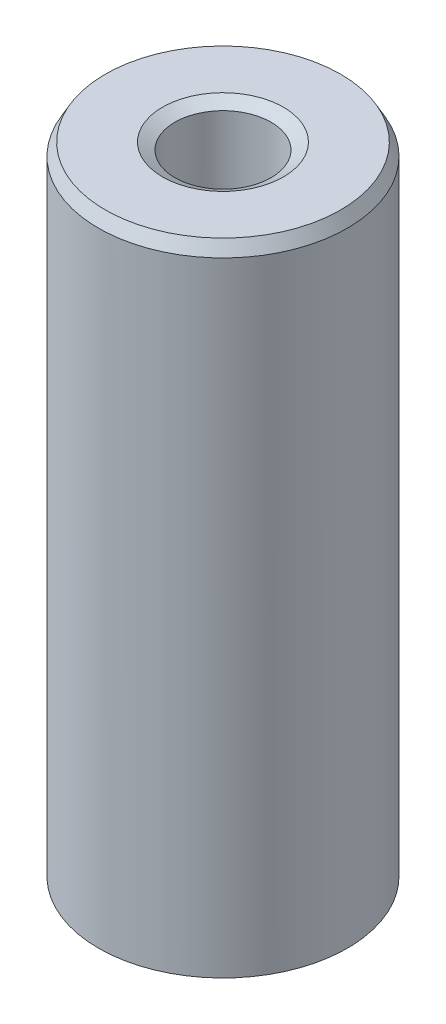
ISO-10303-21;
HEADER;
FILE_DESCRIPTION(('STEP AP214'),'2;1');
FILE_NAME('part.step','',(''),(''),'','','');
FILE_SCHEMA(('AUTOMOTIVE_DESIGN { 1 0 10303 214 1 1 1 1 }'));
ENDSEC;
DATA;
#1=APPLICATION_CONTEXT('core data for automotive mechanical design processes');
#2=APPLICATION_PROTOCOL_DEFINITION('international standard','automotive_design',2000,#1);
#3=PRODUCT_CONTEXT('',#1,'mechanical');
#4=PRODUCT('Part','Part','',(#3));
#5=PRODUCT_RELATED_PRODUCT_CATEGORY('part','',(#4));
#6=PRODUCT_DEFINITION_FORMATION('','',#4);
#7=PRODUCT_DEFINITION_CONTEXT('part definition',#1,'design');
#8=PRODUCT_DEFINITION('design','',#6,#7);
#9=PRODUCT_DEFINITION_SHAPE('','',#8);
#10=(LENGTH_UNIT() NAMED_UNIT(*) SI_UNIT(.MILLI.,.METRE.));
#11=(NAMED_UNIT(*) PLANE_ANGLE_UNIT() SI_UNIT($,.RADIAN.));
#12=(NAMED_UNIT(*) SI_UNIT($,.STERADIAN.) SOLID_ANGLE_UNIT());
#13=UNCERTAINTY_MEASURE_WITH_UNIT(LENGTH_MEASURE(1.E-05),#10,'distance_accuracy_value','');
#14=(GEOMETRIC_REPRESENTATION_CONTEXT(3) GLOBAL_UNCERTAINTY_ASSIGNED_CONTEXT((#13)) GLOBAL_UNIT_ASSIGNED_CONTEXT((#10,
#11,#12)) REPRESENTATION_CONTEXT('',''));
#15=CARTESIAN_POINT('',(0.,0.,0.));
#16=DIRECTION('',(0.,0.,1.));
#17=DIRECTION('',(1.,0.,0.));
#18=AXIS2_PLACEMENT_3D('',#15,#16,#17);
#19=CARTESIAN_POINT('',(0.,38.7265700817911,0.));
#20=DIRECTION('',(0.,-1.,0.));
#21=DIRECTION('',(0.,0.,-1.));
#22=AXIS2_PLACEMENT_3D('',#19,#20,#21);
#23=CYLINDRICAL_SURFACE('',#22,7.5);
#24=CARTESIAN_POINT('',(0.,0.412156137593274,0.));
#25=DIRECTION('',(0.,1.,0.));
#26=DIRECTION('',(0.,0.,1.));
#27=AXIS2_PLACEMENT_3D('',#24,#25,#26);
#28=CIRCLE('',#27,7.5);
#29=CARTESIAN_POINT('',(0.,0.412156137593274,7.5));
#30=VERTEX_POINT('',#29);
#31=EDGE_CURVE('E10',#30,#30,#28,.T.);
#32=ORIENTED_EDGE('',*,*,#31,.T.);
#33=EDGE_LOOP('',(#32));
#34=FACE_BOUND('',#33,.T.);
#35=CARTESIAN_POINT('',(0.,37.9817657309653,0.));
#36=DIRECTION('',(0.,1.,0.));
#37=DIRECTION('',(0.,0.,1.));
#38=AXIS2_PLACEMENT_3D('',#35,#36,#37);
#39=CIRCLE('',#38,7.5);
#40=CARTESIAN_POINT('',(0.,37.9817657309653,-7.5));
#41=VERTEX_POINT('',#40);
#42=EDGE_CURVE('E50',#41,#41,#39,.F.);
#43=ORIENTED_EDGE('',*,*,#42,.T.);
#44=EDGE_LOOP('',(#43));
#45=FACE_BOUND('',#44,.T.);
#46=ADVANCED_FACE('F39',(#34,#45),#23,.T.);
#47=CARTESIAN_POINT('',(0.,38.7265700817911,0.));
#48=DIRECTION('',(0.,1.,0.));
#49=DIRECTION('',(0.,0.,1.));
#50=AXIS2_PLACEMENT_3D('',#47,#48,#49);
#51=PLANE('',#50);
#52=CARTESIAN_POINT('',(0.,38.7265700817911,0.));
#53=DIRECTION('',(0.,1.,0.));
#54=DIRECTION('',(0.,0.,1.));
#55=AXIS2_PLACEMENT_3D('',#52,#53,#54);
#56=CIRCLE('',#55,3.64341348879733);
#57=CARTESIAN_POINT('',(0.,38.7265700817911,3.64341348879733));
#58=VERTEX_POINT('',#57);
#59=EDGE_CURVE('E58',#58,#58,#56,.F.);
#60=ORIENTED_EDGE('',*,*,#59,.T.);
#61=EDGE_LOOP('',(#60));
#62=FACE_BOUND('',#61,.T.);
#63=CARTESIAN_POINT('',(0.,38.7265700817911,0.));
#64=DIRECTION('',(0.,1.,0.));
#65=DIRECTION('',(0.,0.,1.));
#66=AXIS2_PLACEMENT_3D('',#63,#64,#65);
#67=CIRCLE('',#66,7.08784386240673);
#68=CARTESIAN_POINT('',(0.,38.7265700817911,-7.08784386240673));
#69=VERTEX_POINT('',#68);
#70=EDGE_CURVE('E61',#69,#69,#67,.T.);
#71=ORIENTED_EDGE('',*,*,#70,.T.);
#72=EDGE_LOOP('',(#71));
#73=FACE_BOUND('',#72,.T.);
#74=ADVANCED_FACE('F88',(#62,#73),#51,.T.);
#75=CARTESIAN_POINT('',(0.,0.,0.));
#76=DIRECTION('',(0.,1.,0.));
#77=DIRECTION('',(0.,0.,1.));
#78=AXIS2_PLACEMENT_3D('',#75,#76,#77);
#79=PLANE('',#78);
#80=CARTESIAN_POINT('',(0.,0.,0.));
#81=DIRECTION('',(0.,1.,0.));
#82=DIRECTION('',(0.,0.,1.));
#83=AXIS2_PLACEMENT_3D('',#80,#81,#82);
#84=CIRCLE('',#83,3.31076527556486);
#85=CARTESIAN_POINT('',(0.,0.,-3.31076527556486));
#86=VERTEX_POINT('',#85);
#87=EDGE_CURVE('E51',#86,#86,#84,.T.);
#88=ORIENTED_EDGE('',*,*,#87,.T.);
#89=EDGE_LOOP('',(#88));
#90=FACE_BOUND('',#89,.T.);
#91=CARTESIAN_POINT('',(0.,0.,0.));
#92=DIRECTION('',(0.,1.,0.));
#93=DIRECTION('',(0.,0.,1.));
#94=AXIS2_PLACEMENT_3D('',#91,#92,#93);
#95=CIRCLE('',#94,6.75519564917425);
#96=CARTESIAN_POINT('',(0.,0.,6.75519564917425));
#97=VERTEX_POINT('',#96);
#98=EDGE_CURVE('E54',#97,#97,#95,.F.);
#99=ORIENTED_EDGE('',*,*,#98,.T.);
#100=EDGE_LOOP('',(#99));
#101=FACE_BOUND('',#100,.T.);
#102=ADVANCED_FACE('F83',(#90,#101),#79,.F.);
#103=CARTESIAN_POINT('',(0.,38.7265700817911,0.));
#104=DIRECTION('',(0.,-1.,0.));
#105=DIRECTION('',(0.,0.,-1.));
#106=AXIS2_PLACEMENT_3D('',#103,#104,#105);
#107=CYLINDRICAL_SURFACE('',#106,2.89860913797159);
#108=CARTESIAN_POINT('',(0.,38.3144139441978,0.));
#109=DIRECTION('',(0.,1.,0.));
#110=DIRECTION('',(0.,0.,1.));
#111=AXIS2_PLACEMENT_3D('',#108,#109,#110);
#112=CIRCLE('',#111,2.89860913797159);
#113=CARTESIAN_POINT('',(0.,38.3144139441978,2.89860913797159));
#114=VERTEX_POINT('',#113);
#115=EDGE_CURVE('E67',#114,#114,#112,.T.);
#116=ORIENTED_EDGE('',*,*,#115,.T.);
#117=EDGE_LOOP('',(#116));
#118=FACE_BOUND('',#117,.T.);
#119=CARTESIAN_POINT('',(0.,0.744804350825752,0.));
#120=DIRECTION('',(0.,1.,0.));
#121=DIRECTION('',(0.,0.,1.));
#122=AXIS2_PLACEMENT_3D('',#119,#120,#121);
#123=CIRCLE('',#122,2.89860913797159);
#124=CARTESIAN_POINT('',(0.,0.744804350825752,-2.89860913797159));
#125=VERTEX_POINT('',#124);
#126=EDGE_CURVE('E69',#125,#125,#123,.F.);
#127=ORIENTED_EDGE('',*,*,#126,.T.);
#128=EDGE_LOOP('',(#127));
#129=FACE_BOUND('',#128,.T.);
#130=ADVANCED_FACE('F71',(#118,#129),#107,.F.);
#131=CARTESIAN_POINT('',(0.,38.3144139441978,0.));
#132=DIRECTION('',(0.,1.,0.));
#133=DIRECTION('',(0.,0.,1.));
#134=AXIS2_PLACEMENT_3D('',#131,#132,#133);
#135=CONICAL_SURFACE('',#134,2.89860913797159,1.06536560756224);
#136=ORIENTED_EDGE('',*,*,#59,.F.);
#137=EDGE_LOOP('',(#136));
#138=FACE_BOUND('',#137,.T.);
#139=ORIENTED_EDGE('',*,*,#115,.F.);
#140=EDGE_LOOP('',(#139));
#141=FACE_BOUND('',#140,.T.);
#142=ADVANCED_FACE('F77',(#138,#141),#135,.F.);
#143=CARTESIAN_POINT('',(0.,0.,0.));
#144=DIRECTION('',(0.,-1.,0.));
#145=DIRECTION('',(0.,0.,-1.));
#146=AXIS2_PLACEMENT_3D('',#143,#144,#145);
#147=CONICAL_SURFACE('',#146,3.31076527556486,0.50543071923265);
#148=CARTESIAN_POINT('',(0.,0.744804350825752,-2.89860913797159));
#149=CARTESIAN_POINT('',(0.,0.737045972171317,-2.90290243107152));
#150=CARTESIAN_POINT('',(0.,0.729287593516882,-2.90719572417145));
#151=CARTESIAN_POINT('',(0.,0.713770836208012,-2.91578231037131));
#152=CARTESIAN_POINT('',(0.,0.706012457553577,-2.92007560347124));
#153=CARTESIAN_POINT('',(0.,0.690495700244708,-2.9286621896711));
#154=CARTESIAN_POINT('',(0.,0.682737321590273,-2.93295548277103));
#155=CARTESIAN_POINT('',(0.,0.667220564281403,-2.94154206897089));
#156=CARTESIAN_POINT('',(0.,0.659462185626968,-2.94583536207082));
#157=CARTESIAN_POINT('',(0.,0.643945428318098,-2.95442194827068));
#158=CARTESIAN_POINT('',(0.,0.636187049663663,-2.95871524137061));
#159=CARTESIAN_POINT('',(0.,0.620670292354793,-2.96730182757047));
#160=CARTESIAN_POINT('',(0.,0.612911913700358,-2.9715951206704));
#161=CARTESIAN_POINT('',(0.,0.597395156391489,-2.98018170687026));
#162=CARTESIAN_POINT('',(0.,0.589636777737054,-2.98447499997018));
#163=CARTESIAN_POINT('',(0.,0.574120020428184,-2.99306158617004));
#164=CARTESIAN_POINT('',(0.,0.566361641773749,-2.99735487926997));
#165=CARTESIAN_POINT('',(0.,0.550844884464879,-3.00594146546983));
#166=CARTESIAN_POINT('',(0.,0.543086505810444,-3.01023475856976));
#167=CARTESIAN_POINT('',(0.,0.527569748501574,-3.01882134476962));
#168=CARTESIAN_POINT('',(0.,0.519811369847139,-3.02311463786955));
#169=CARTESIAN_POINT('',(0.,0.50429461253827,-3.03170122406941));
#170=CARTESIAN_POINT('',(0.,0.496536233883835,-3.03599451716934));
#171=CARTESIAN_POINT('',(0.,0.481019476574965,-3.0445811033692));
#172=CARTESIAN_POINT('',(0.,0.47326109792053,-3.04887439646913));
#173=CARTESIAN_POINT('',(0.,0.45774434061166,-3.05746098266899));
#174=CARTESIAN_POINT('',(0.,0.449985961957225,-3.06175427576892));
#175=CARTESIAN_POINT('',(0.,0.434469204648355,-3.07034086196878));
#176=CARTESIAN_POINT('',(0.,0.42671082599392,-3.07463415506871));
#177=CARTESIAN_POINT('',(0.,0.411194068685051,-3.08322074126857));
#178=CARTESIAN_POINT('',(0.,0.403435690030616,-3.0875140343685));
#179=CARTESIAN_POINT('',(0.,0.387918932721746,-3.09610062056836));
#180=CARTESIAN_POINT('',(0.,0.380160554067311,-3.10039391366829));
#181=CARTESIAN_POINT('',(0.,0.364643796758441,-3.10898049986815));
#182=CARTESIAN_POINT('',(0.,0.356885418104006,-3.11327379296808));
#183=CARTESIAN_POINT('',(0.,0.341368660795136,-3.12186037916794));
#184=CARTESIAN_POINT('',(0.,0.333610282140701,-3.12615367226787));
#185=CARTESIAN_POINT('',(0.,0.318093524831832,-3.13474025846773));
#186=CARTESIAN_POINT('',(0.,0.310335146177397,-3.13903355156766));
#187=CARTESIAN_POINT('',(0.,0.294818388868527,-3.14762013776752));
#188=CARTESIAN_POINT('',(0.,0.287060010214092,-3.15191343086745));
#189=CARTESIAN_POINT('',(0.,0.271543252905222,-3.16050001706731));
#190=CARTESIAN_POINT('',(0.,0.263784874250787,-3.16479331016724));
#191=CARTESIAN_POINT('',(0.,0.248268116941917,-3.1733798963671));
#192=CARTESIAN_POINT('',(0.,0.240509738287482,-3.17767318946703));
#193=CARTESIAN_POINT('',(0.,0.224992980978613,-3.18625977566689));
#194=CARTESIAN_POINT('',(0.,0.217234602324178,-3.19055306876682));
#195=CARTESIAN_POINT('',(0.,0.201717845015308,-3.19913965496668));
#196=CARTESIAN_POINT('',(0.,0.193959466360873,-3.20343294806661));
#197=CARTESIAN_POINT('',(0.,0.178442709052003,-3.21201953426647));
#198=CARTESIAN_POINT('',(0.,0.170684330397568,-3.2163128273664));
#199=CARTESIAN_POINT('',(0.,0.155167573088698,-3.22489941356626));
#200=CARTESIAN_POINT('',(0.,0.147409194434263,-3.22919270666619));
#201=CARTESIAN_POINT('',(0.,0.131892437125394,-3.23777929286605));
#202=CARTESIAN_POINT('',(0.,0.124134058470959,-3.24207258596598));
#203=CARTESIAN_POINT('',(0.,0.108617301162089,-3.25065917216584));
#204=CARTESIAN_POINT('',(0.,0.100858922507654,-3.25495246526577));
#205=CARTESIAN_POINT('',(0.,0.0853421651987841,-3.26353905146563));
#206=CARTESIAN_POINT('',(0.,0.0775837865443492,-3.26783234456556));
#207=CARTESIAN_POINT('',(0.,0.0620670292354793,-3.27641893076542));
#208=CARTESIAN_POINT('',(0.,0.0543086505810444,-3.28071222386535));
#209=CARTESIAN_POINT('',(0.,0.0387918932721746,-3.28929881006521));
#210=CARTESIAN_POINT('',(0.,0.0310335146177397,-3.29359210316514));
#211=CARTESIAN_POINT('',(0.,0.0155167573088698,-3.302178689365));
#212=CARTESIAN_POINT('',(0.,0.00775837865443492,-3.30647198246493));
#213=CARTESIAN_POINT('',(0.,0.,-3.31076527556486));
#214=B_SPLINE_CURVE_WITH_KNOTS('',3,(#148,#149,#150,#151,#152,#153,#154,#155,#156,#157,#158,
#159,#160,#161,#162,#163,#164,#165,#166,#167,#168,#169,#170,#171,#172,#173,#174,#175,#176,#177,
#178,#179,#180,#181,#182,#183,#184,#185,#186,#187,#188,#189,#190,#191,#192,#193,#194,#195,#196,
#197,#198,#199,#200,#201,#202,#203,#204,#205,#206,#207,#208,#209,#210,#211,#212,#213),
.UNSPECIFIED.,.F.,.F.,(4,2,2,2,2,2,2,2,2,2,2,2,2,2,2,2,2,2,2,2,2,2,2,2,2,2,2,2,2,2,2,2,4),(0.,
0.0266011887871101,0.0532023775742202,0.0798035663613302,0.106404755148441,0.133005943935551,
0.159607132722661,0.186208321509771,0.212809510296881,0.239410699083991,0.266011887871101,
0.292613076658211,0.319214265445321,0.345815454232431,0.372416643019542,0.399017831806652,
0.425619020593762,0.452220209380872,0.478821398167982,0.505422586955092,0.532023775742202,
0.558624964529312,0.585226153316422,0.611827342103533,0.638428530890643,0.665029719677753,
0.691630908464863,0.718232097251973,0.744833286039083,0.771434474826193,0.798035663613303,
0.824636852400414,0.851238041187524),.UNSPECIFIED.);
#215=EDGE_CURVE('BSEAM73',#125,#86,#214,.T.);
#216=ORIENTED_EDGE('',*,*,#126,.F.);
#217=ORIENTED_EDGE('',*,*,#87,.F.);
#218=ORIENTED_EDGE('',*,*,#215,.T.);
#219=ORIENTED_EDGE('',*,*,#215,.F.);
#220=EDGE_LOOP('',(#216,#218,#217,#219));
#221=FACE_BOUND('',#220,.T.);
#222=ADVANCED_FACE('F73',(#221),#147,.F.);
#223=CARTESIAN_POINT('',(0.,0.412156137593274,0.));
#224=DIRECTION('',(0.,1.,0.));
#225=DIRECTION('',(0.,0.,1.));
#226=AXIS2_PLACEMENT_3D('',#223,#224,#225);
#227=CONICAL_SURFACE('',#226,7.5,1.06536560756224);
#228=ORIENTED_EDGE('',*,*,#98,.F.);
#229=EDGE_LOOP('',(#228));
#230=FACE_BOUND('',#229,.T.);
#231=ORIENTED_EDGE('',*,*,#31,.F.);
#232=EDGE_LOOP('',(#231));
#233=FACE_BOUND('',#232,.T.);
#234=ADVANCED_FACE('F76',(#230,#233),#227,.T.);
#235=CARTESIAN_POINT('',(0.,38.7265700817911,0.));
#236=DIRECTION('',(0.,-1.,0.));
#237=DIRECTION('',(0.,0.,-1.));
#238=AXIS2_PLACEMENT_3D('',#235,#236,#237);
#239=CONICAL_SURFACE('',#238,7.08784386240673,0.505430719232652);
#240=CARTESIAN_POINT('',(0.,37.9817657309653,-7.5));
#241=CARTESIAN_POINT('',(0.,37.9895241096198,-7.49570670690007));
#242=CARTESIAN_POINT('',(0.,37.9972824882742,-7.49141341380014));
#243=CARTESIAN_POINT('',(0.,38.0127992455831,-7.48282682760028));
#244=CARTESIAN_POINT('',(0.,38.0205576242375,-7.47853353450035));
#245=CARTESIAN_POINT('',(0.,38.0360743815464,-7.46994694830049));
#246=CARTESIAN_POINT('',(0.,38.0438327602008,-7.46565365520056));
#247=CARTESIAN_POINT('',(0.,38.0593495175097,-7.4570670690007));
#248=CARTESIAN_POINT('',(0.,38.0671078961641,-7.45277377590077));
#249=CARTESIAN_POINT('',(0.,38.082624653473,-7.44418718970091));
#250=CARTESIAN_POINT('',(0.,38.0903830321274,-7.43989389660098));
#251=CARTESIAN_POINT('',(0.,38.1058997894363,-7.43130731040112));
#252=CARTESIAN_POINT('',(0.,38.1136581680907,-7.42701401730119));
#253=CARTESIAN_POINT('',(0.,38.1291749253996,-7.41842743110133));
#254=CARTESIAN_POINT('',(0.,38.136933304054,-7.4141341380014));
#255=CARTESIAN_POINT('',(0.,38.1524500613629,-7.40554755180154));
#256=CARTESIAN_POINT('',(0.,38.1602084400173,-7.40125425870161));
#257=CARTESIAN_POINT('',(0.,38.1757251973262,-7.39266767250175));
#258=CARTESIAN_POINT('',(0.,38.1834835759807,-7.38837437940182));
#259=CARTESIAN_POINT('',(0.,38.1990003332895,-7.37978779320196));
#260=CARTESIAN_POINT('',(0.,38.206758711944,-7.37549450010203));
#261=CARTESIAN_POINT('',(0.,38.2222754692528,-7.36690791390217));
#262=CARTESIAN_POINT('',(0.,38.2300338479073,-7.36261462080224));
#263=CARTESIAN_POINT('',(0.,38.2455506052161,-7.35402803460239));
#264=CARTESIAN_POINT('',(0.,38.2533089838706,-7.34973474150245));
#265=CARTESIAN_POINT('',(0.,38.2688257411794,-7.3411481553026));
#266=CARTESIAN_POINT('',(0.,38.2765841198339,-7.33685486220267));
#267=CARTESIAN_POINT('',(0.,38.2921008771427,-7.32826827600281));
#268=CARTESIAN_POINT('',(0.,38.2998592557972,-7.32397498290288));
#269=CARTESIAN_POINT('',(0.,38.315376013106,-7.31538839670301));
#270=CARTESIAN_POINT('',(0.,38.3231343917605,-7.31109510360309));
#271=CARTESIAN_POINT('',(0.,38.3386511490693,-7.30250851740323));
#272=CARTESIAN_POINT('',(0.,38.3464095277238,-7.2982152243033));
#273=CARTESIAN_POINT('',(0.,38.3619262850327,-7.28962863810344));
#274=CARTESIAN_POINT('',(0.,38.3696846636871,-7.28533534500351));
#275=CARTESIAN_POINT('',(0.,38.385201420996,-7.27674875880365));
#276=CARTESIAN_POINT('',(0.,38.3929597996504,-7.27245546570372));
#277=CARTESIAN_POINT('',(0.,38.4084765569593,-7.26386887950386));
#278=CARTESIAN_POINT('',(0.,38.4162349356137,-7.25957558640393));
#279=CARTESIAN_POINT('',(0.,38.4317516929226,-7.25098900020407));
#280=CARTESIAN_POINT('',(0.,38.439510071577,-7.24669570710414));
#281=CARTESIAN_POINT('',(0.,38.4550268288859,-7.23810912090428));
#282=CARTESIAN_POINT('',(0.,38.4627852075403,-7.23381582780435));
#283=CARTESIAN_POINT('',(0.,38.4783019648492,-7.22522924160449));
#284=CARTESIAN_POINT('',(0.,38.4860603435036,-7.22093594850456));
#285=CARTESIAN_POINT('',(0.,38.5015771008125,-7.2123493623047));
#286=CARTESIAN_POINT('',(0.,38.5093354794669,-7.20805606920477));
#287=CARTESIAN_POINT('',(0.,38.5248522367758,-7.19946948300491));
#288=CARTESIAN_POINT('',(0.,38.5326106154302,-7.19517618990498));
#289=CARTESIAN_POINT('',(0.,38.5481273727391,-7.18658960370512));
#290=CARTESIAN_POINT('',(0.,38.5558857513935,-7.18229631060519));
#291=CARTESIAN_POINT('',(0.,38.5714025087024,-7.17370972440533));
#292=CARTESIAN_POINT('',(0.,38.5791608873568,-7.1694164313054));
#293=CARTESIAN_POINT('',(0.,38.5946776446657,-7.16082984510554));
#294=CARTESIAN_POINT('',(0.,38.6024360233201,-7.15653655200561));
#295=CARTESIAN_POINT('',(0.,38.617952780629,-7.14794996580575));
#296=CARTESIAN_POINT('',(0.,38.6257111592834,-7.14365667270582));
#297=CARTESIAN_POINT('',(0.,38.6412279165923,-7.13507008650596));
#298=CARTESIAN_POINT('',(0.,38.6489862952467,-7.13077679340603));
#299=CARTESIAN_POINT('',(0.,38.6645030525556,-7.12219020720617));
#300=CARTESIAN_POINT('',(0.,38.67226143121,-7.11789691410624));
#301=CARTESIAN_POINT('',(0.,38.6877781885189,-7.10931032790638));
#302=CARTESIAN_POINT('',(0.,38.6955365671734,-7.10501703480645));
#303=CARTESIAN_POINT('',(0.,38.7110533244822,-7.09643044860659));
#304=CARTESIAN_POINT('',(0.,38.7188117031367,-7.09213715550666));
#305=CARTESIAN_POINT('',(0.,38.7265700817911,-7.08784386240673));
#306=B_SPLINE_CURVE_WITH_KNOTS('',3,(#240,#241,#242,#243,#244,#245,#246,#247,#248,#249,#250,
#251,#252,#253,#254,#255,#256,#257,#258,#259,#260,#261,#262,#263,#264,#265,#266,#267,#268,#269,
#270,#271,#272,#273,#274,#275,#276,#277,#278,#279,#280,#281,#282,#283,#284,#285,#286,#287,#288,
#289,#290,#291,#292,#293,#294,#295,#296,#297,#298,#299,#300,#301,#302,#303,#304,#305),
.UNSPECIFIED.,.F.,.F.,(4,2,2,2,2,2,2,2,2,2,2,2,2,2,2,2,2,2,2,2,2,2,2,2,2,2,2,2,2,2,2,2,4),(0.,
0.0266011887871114,0.0532023775742228,0.0798035663613342,0.106404755148446,0.133005943935551,
0.159607132722662,0.186208321509774,0.212809510296886,0.239410699083997,0.266011887871102,
0.292613076658214,0.319214265445325,0.345815454232436,0.372416643019542,0.399017831806654,
0.425619020593765,0.452220209380876,0.478821398167988,0.505422586955093,0.532023775742204,
0.558624964529316,0.585226153316427,0.611827342103533,0.638428530890644,0.665029719677756,
0.691630908464867,0.718232097251979,0.744833286039084,0.771434474826195,0.798035663613307,
0.824636852400419,0.85123804118753),.UNSPECIFIED.);
#307=EDGE_CURVE('BSEAM45',#41,#69,#306,.T.);
#308=ORIENTED_EDGE('',*,*,#42,.F.);
#309=ORIENTED_EDGE('',*,*,#70,.F.);
#310=ORIENTED_EDGE('',*,*,#307,.T.);
#311=ORIENTED_EDGE('',*,*,#307,.F.);
#312=EDGE_LOOP('',(#308,#310,#309,#311));
#313=FACE_BOUND('',#312,.T.);
#314=ADVANCED_FACE('F45',(#313),#239,.T.);
#315=CLOSED_SHELL('',(#46,#74,#102,#130,#142,#222,#234,#314));
#316=MANIFOLD_SOLID_BREP('B2',#315);
#317=ADVANCED_BREP_SHAPE_REPRESENTATION('',(#18,#316),#14);
#318=SHAPE_DEFINITION_REPRESENTATION(#9,#317);
ENDSEC;
END-ISO-10303-21;
